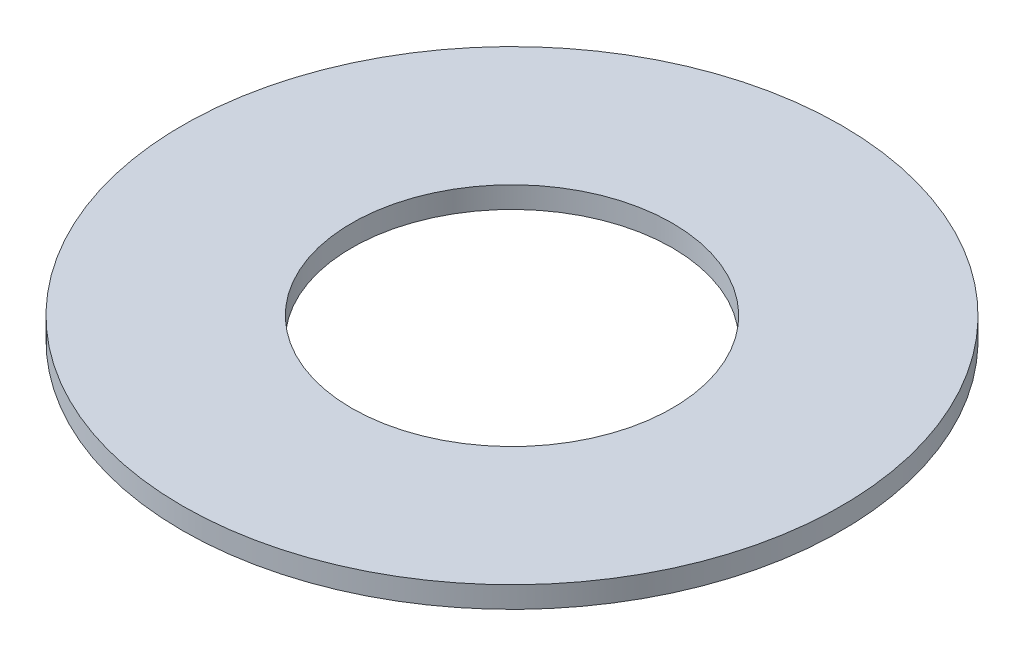
ISO-10303-21;
HEADER;
FILE_DESCRIPTION(('STEP AP214'),'2;1');
FILE_NAME('part.step','',(''),(''),'','','');
FILE_SCHEMA(('AUTOMOTIVE_DESIGN { 1 0 10303 214 1 1 1 1 }'));
ENDSEC;
DATA;
#1=APPLICATION_CONTEXT('core data for automotive mechanical design processes');
#2=APPLICATION_PROTOCOL_DEFINITION('international standard','automotive_design',2000,#1);
#3=PRODUCT_CONTEXT('',#1,'mechanical');
#4=PRODUCT('Part','Part','',(#3));
#5=PRODUCT_RELATED_PRODUCT_CATEGORY('part','',(#4));
#6=PRODUCT_DEFINITION_FORMATION('','',#4);
#7=PRODUCT_DEFINITION_CONTEXT('part definition',#1,'design');
#8=PRODUCT_DEFINITION('design','',#6,#7);
#9=PRODUCT_DEFINITION_SHAPE('','',#8);
#10=(LENGTH_UNIT() NAMED_UNIT(*) SI_UNIT(.MILLI.,.METRE.));
#11=(NAMED_UNIT(*) PLANE_ANGLE_UNIT() SI_UNIT($,.RADIAN.));
#12=(NAMED_UNIT(*) SI_UNIT($,.STERADIAN.) SOLID_ANGLE_UNIT());
#13=UNCERTAINTY_MEASURE_WITH_UNIT(LENGTH_MEASURE(1.E-05),#10,'distance_accuracy_value','');
#14=(GEOMETRIC_REPRESENTATION_CONTEXT(3) GLOBAL_UNCERTAINTY_ASSIGNED_CONTEXT((#13)) GLOBAL_UNIT_ASSIGNED_CONTEXT((#10,
#11,#12)) REPRESENTATION_CONTEXT('',''));
#15=CARTESIAN_POINT('',(0.,0.,0.));
#16=DIRECTION('',(0.,0.,1.));
#17=DIRECTION('',(1.,0.,0.));
#18=AXIS2_PLACEMENT_3D('',#15,#16,#17);
#19=CARTESIAN_POINT('',(0.,6.,0.));
#20=DIRECTION('',(0.,-1.,0.));
#21=DIRECTION('',(0.,0.,-1.));
#22=AXIS2_PLACEMENT_3D('',#19,#20,#21);
#23=CYLINDRICAL_SURFACE('',#22,92.5);
#24=CARTESIAN_POINT('',(0.,6.,0.));
#25=DIRECTION('',(0.,1.,0.));
#26=DIRECTION('',(0.,0.,1.));
#27=AXIS2_PLACEMENT_3D('',#24,#25,#26);
#28=CIRCLE('',#27,92.5);
#29=CARTESIAN_POINT('',(0.,6.,92.5));
#30=VERTEX_POINT('',#29);
#31=EDGE_CURVE('E10',#30,#30,#28,.T.);
#32=ORIENTED_EDGE('',*,*,#31,.F.);
#33=EDGE_LOOP('',(#32));
#34=FACE_BOUND('',#33,.T.);
#35=CARTESIAN_POINT('',(0.,0.,0.));
#36=DIRECTION('',(0.,1.,0.));
#37=DIRECTION('',(0.,0.,1.));
#38=AXIS2_PLACEMENT_3D('',#35,#36,#37);
#39=CIRCLE('',#38,92.5);
#40=CARTESIAN_POINT('',(0.,0.,92.5));
#41=VERTEX_POINT('',#40);
#42=EDGE_CURVE('E37',#41,#41,#39,.T.);
#43=ORIENTED_EDGE('',*,*,#42,.T.);
#44=EDGE_LOOP('',(#43));
#45=FACE_BOUND('',#44,.T.);
#46=ADVANCED_FACE('F40',(#34,#45),#23,.T.);
#47=CARTESIAN_POINT('',(0.,6.,0.));
#48=DIRECTION('',(0.,1.,0.));
#49=DIRECTION('',(0.,0.,1.));
#50=AXIS2_PLACEMENT_3D('',#47,#48,#49);
#51=PLANE('',#50);
#52=CARTESIAN_POINT('',(0.,6.,0.));
#53=DIRECTION('',(0.,1.,0.));
#54=DIRECTION('',(0.,0.,1.));
#55=AXIS2_PLACEMENT_3D('',#52,#53,#54);
#56=CIRCLE('',#55,45.);
#57=CARTESIAN_POINT('',(0.,6.,45.));
#58=VERTEX_POINT('',#57);
#59=EDGE_CURVE('E50',#58,#58,#56,.T.);
#60=ORIENTED_EDGE('',*,*,#59,.F.);
#61=EDGE_LOOP('',(#60));
#62=FACE_BOUND('',#61,.T.);
#63=ORIENTED_EDGE('',*,*,#31,.T.);
#64=EDGE_LOOP('',(#63));
#65=FACE_BOUND('',#64,.T.);
#66=ADVANCED_FACE('F59',(#62,#65),#51,.T.);
#67=CARTESIAN_POINT('',(0.,0.,0.));
#68=DIRECTION('',(0.,1.,0.));
#69=DIRECTION('',(0.,0.,1.));
#70=AXIS2_PLACEMENT_3D('',#67,#68,#69);
#71=PLANE('',#70);
#72=CARTESIAN_POINT('',(0.,0.,0.));
#73=DIRECTION('',(0.,1.,0.));
#74=DIRECTION('',(0.,0.,1.));
#75=AXIS2_PLACEMENT_3D('',#72,#73,#74);
#76=CIRCLE('',#75,45.);
#77=CARTESIAN_POINT('',(0.,0.,45.));
#78=VERTEX_POINT('',#77);
#79=EDGE_CURVE('E47',#78,#78,#76,.T.);
#80=ORIENTED_EDGE('',*,*,#79,.T.);
#81=EDGE_LOOP('',(#80));
#82=FACE_BOUND('',#81,.T.);
#83=ORIENTED_EDGE('',*,*,#42,.F.);
#84=EDGE_LOOP('',(#83));
#85=FACE_BOUND('',#84,.T.);
#86=ADVANCED_FACE('F58',(#82,#85),#71,.F.);
#87=CARTESIAN_POINT('',(0.,6.,0.));
#88=DIRECTION('',(0.,-1.,0.));
#89=DIRECTION('',(0.,0.,-1.));
#90=AXIS2_PLACEMENT_3D('',#87,#88,#89);
#91=CYLINDRICAL_SURFACE('',#90,45.);
#92=ORIENTED_EDGE('',*,*,#59,.T.);
#93=EDGE_LOOP('',(#92));
#94=FACE_BOUND('',#93,.T.);
#95=ORIENTED_EDGE('',*,*,#79,.F.);
#96=EDGE_LOOP('',(#95));
#97=FACE_BOUND('',#96,.T.);
#98=ADVANCED_FACE('F54',(#94,#97),#91,.F.);
#99=CLOSED_SHELL('',(#46,#66,#86,#98));
#100=MANIFOLD_SOLID_BREP('B2',#99);
#101=ADVANCED_BREP_SHAPE_REPRESENTATION('',(#18,#100),#14);
#102=SHAPE_DEFINITION_REPRESENTATION(#9,#101);
ENDSEC;
END-ISO-10303-21;
